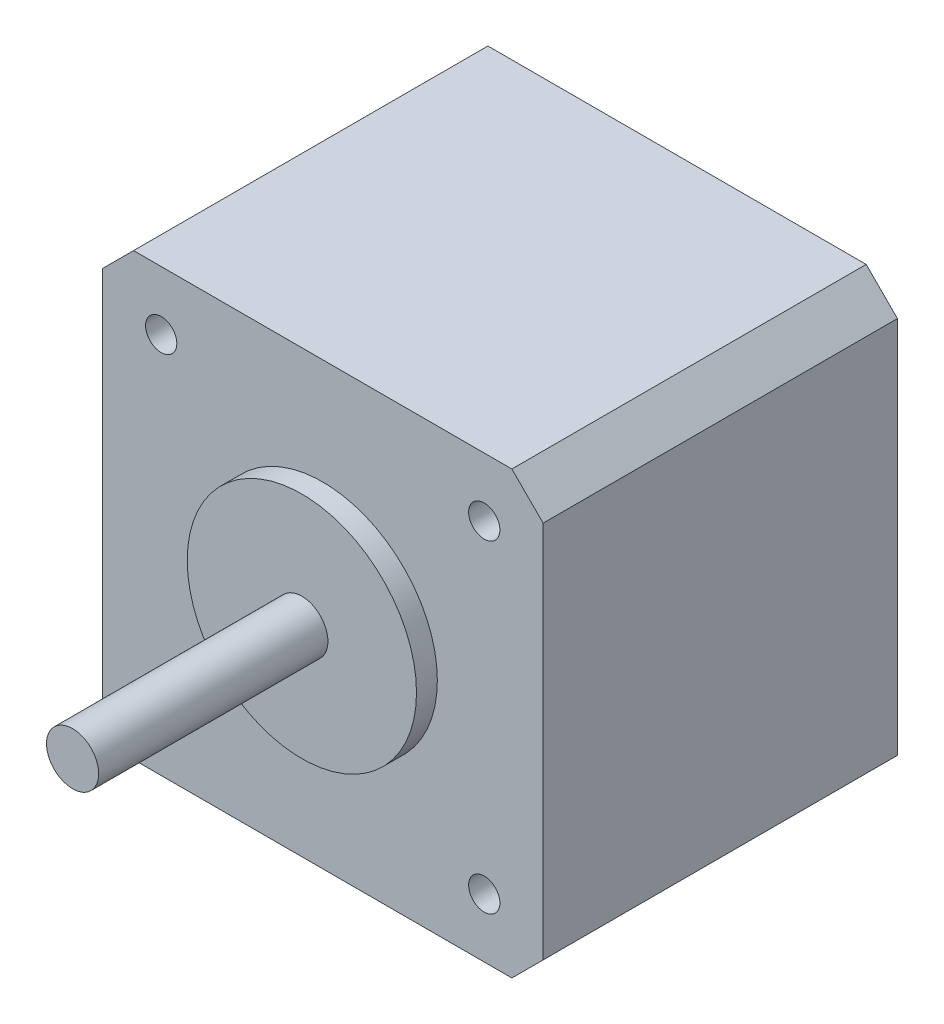
ISO-10303-21;
HEADER;
FILE_DESCRIPTION(('STEP AP214'),'2;1');
FILE_NAME('part.step','',(''),(''),'','','');
FILE_SCHEMA(('AUTOMOTIVE_DESIGN { 1 0 10303 214 1 1 1 1 }'));
ENDSEC;
DATA;
#1=APPLICATION_CONTEXT('core data for automotive mechanical design processes');
#2=APPLICATION_PROTOCOL_DEFINITION('international standard','automotive_design',2000,#1);
#3=PRODUCT_CONTEXT('',#1,'mechanical');
#4=PRODUCT('Part','Part','',(#3));
#5=PRODUCT_RELATED_PRODUCT_CATEGORY('part','',(#4));
#6=PRODUCT_DEFINITION_FORMATION('','',#4);
#7=PRODUCT_DEFINITION_CONTEXT('part definition',#1,'design');
#8=PRODUCT_DEFINITION('design','',#6,#7);
#9=PRODUCT_DEFINITION_SHAPE('','',#8);
#10=(LENGTH_UNIT() NAMED_UNIT(*) SI_UNIT(.MILLI.,.METRE.));
#11=(NAMED_UNIT(*) PLANE_ANGLE_UNIT() SI_UNIT($,.RADIAN.));
#12=(NAMED_UNIT(*) SI_UNIT($,.STERADIAN.) SOLID_ANGLE_UNIT());
#13=UNCERTAINTY_MEASURE_WITH_UNIT(LENGTH_MEASURE(1.E-05),#10,'distance_accuracy_value','');
#14=(GEOMETRIC_REPRESENTATION_CONTEXT(3) GLOBAL_UNCERTAINTY_ASSIGNED_CONTEXT((#13)) GLOBAL_UNIT_ASSIGNED_CONTEXT((#10,
#11,#12)) REPRESENTATION_CONTEXT('',''));
#15=CARTESIAN_POINT('',(0.,0.,0.));
#16=DIRECTION('',(0.,0.,1.));
#17=DIRECTION('',(1.,0.,0.));
#18=AXIS2_PLACEMENT_3D('',#15,#16,#17);
#19=CARTESIAN_POINT('',(58.85,21.15,-4.99999999999999));
#20=DIRECTION('',(-1.,0.,0.));
#21=DIRECTION('',(0.,0.,1.));
#22=AXIS2_PLACEMENT_3D('',#19,#20,#21);
#23=PLANE('',#22);
#24=DIRECTION('',(0.,-1.,0.));
#25=VECTOR('',#24,1.);
#26=CARTESIAN_POINT('',(58.85,21.15,29.));
#27=LINE('',#26,#25);
#28=CARTESIAN_POINT('',(58.85,18.15,29.));
#29=VERTEX_POINT('',#28);
#30=CARTESIAN_POINT('',(58.85,-18.15,29.));
#31=VERTEX_POINT('',#30);
#32=EDGE_CURVE('E165',#29,#31,#27,.T.);
#33=ORIENTED_EDGE('',*,*,#32,.F.);
#34=DIRECTION('',(0.,0.,-1.));
#35=VECTOR('',#34,1.);
#36=CARTESIAN_POINT('',(58.85,18.15,-4.99999999999999));
#37=LINE('',#36,#35);
#38=CARTESIAN_POINT('',(58.85,18.15,-4.99999999999999));
#39=VERTEX_POINT('',#38);
#40=EDGE_CURVE('E139',#29,#39,#37,.T.);
#41=ORIENTED_EDGE('',*,*,#40,.T.);
#42=DIRECTION('',(0.,-1.,0.));
#43=VECTOR('',#42,1.);
#44=CARTESIAN_POINT('',(58.85,21.15,-4.99999999999999));
#45=LINE('',#44,#43);
#46=CARTESIAN_POINT('',(58.85,-18.15,-4.99999999999999));
#47=VERTEX_POINT('',#46);
#48=EDGE_CURVE('E120',#39,#47,#45,.T.);
#49=ORIENTED_EDGE('',*,*,#48,.T.);
#50=DIRECTION('',(0.,0.,1.));
#51=VECTOR('',#50,1.);
#52=CARTESIAN_POINT('',(58.85,-18.15,-4.99999999999999));
#53=LINE('',#52,#51);
#54=EDGE_CURVE('E136',#47,#31,#53,.T.);
#55=ORIENTED_EDGE('',*,*,#54,.T.);
#56=EDGE_LOOP('',(#33,#41,#49,#55));
#57=FACE_BOUND('',#56,.T.);
#58=ADVANCED_FACE('F33',(#57),#23,.T.);
#59=CARTESIAN_POINT('',(101.15,21.15,-4.99999999999999));
#60=DIRECTION('',(0.,1.,0.));
#61=DIRECTION('',(-1.,0.,0.));
#62=AXIS2_PLACEMENT_3D('',#59,#60,#61);
#63=PLANE('',#62);
#64=DIRECTION('',(-1.,0.,0.));
#65=VECTOR('',#64,1.);
#66=CARTESIAN_POINT('',(101.15,21.15,-4.99999999999999));
#67=LINE('',#66,#65);
#68=CARTESIAN_POINT('',(98.15,21.15,-4.99999999999999));
#69=VERTEX_POINT('',#68);
#70=CARTESIAN_POINT('',(61.85,21.15,-4.99999999999999));
#71=VERTEX_POINT('',#70);
#72=EDGE_CURVE('E129',#69,#71,#67,.T.);
#73=ORIENTED_EDGE('',*,*,#72,.T.);
#74=DIRECTION('',(0.,0.,1.));
#75=VECTOR('',#74,1.);
#76=CARTESIAN_POINT('',(61.85,21.15,-4.99999999999999));
#77=LINE('',#76,#75);
#78=CARTESIAN_POINT('',(61.85,21.15,29.));
#79=VERTEX_POINT('',#78);
#80=EDGE_CURVE('E119',#71,#79,#77,.T.);
#81=ORIENTED_EDGE('',*,*,#80,.T.);
#82=DIRECTION('',(-1.,0.,0.));
#83=VECTOR('',#82,1.);
#84=CARTESIAN_POINT('',(101.15,21.15,29.));
#85=LINE('',#84,#83);
#86=CARTESIAN_POINT('',(98.15,21.15,29.));
#87=VERTEX_POINT('',#86);
#88=EDGE_CURVE('E103',#87,#79,#85,.T.);
#89=ORIENTED_EDGE('',*,*,#88,.F.);
#90=DIRECTION('',(0.,0.,-1.));
#91=VECTOR('',#90,1.);
#92=CARTESIAN_POINT('',(98.15,21.15,-4.99999999999999));
#93=LINE('',#92,#91);
#94=EDGE_CURVE('E116',#87,#69,#93,.T.);
#95=ORIENTED_EDGE('',*,*,#94,.T.);
#96=EDGE_LOOP('',(#73,#81,#89,#95));
#97=FACE_BOUND('',#96,.T.);
#98=ADVANCED_FACE('F115',(#97),#63,.T.);
#99=CARTESIAN_POINT('',(101.15,-21.15,-4.99999999999999));
#100=DIRECTION('',(1.,0.,0.));
#101=DIRECTION('',(0.,0.,-1.));
#102=AXIS2_PLACEMENT_3D('',#99,#100,#101);
#103=PLANE('',#102);
#104=DIRECTION('',(0.,1.,0.));
#105=VECTOR('',#104,1.);
#106=CARTESIAN_POINT('',(101.15,-21.15,-4.99999999999999));
#107=LINE('',#106,#105);
#108=CARTESIAN_POINT('',(101.15,-18.15,-4.99999999999999));
#109=VERTEX_POINT('',#108);
#110=CARTESIAN_POINT('',(101.15,18.15,-4.99999999999999));
#111=VERTEX_POINT('',#110);
#112=EDGE_CURVE('E154',#109,#111,#107,.T.);
#113=ORIENTED_EDGE('',*,*,#112,.T.);
#114=DIRECTION('',(0.,0.,1.));
#115=VECTOR('',#114,1.);
#116=CARTESIAN_POINT('',(101.15,18.15,-4.99999999999999));
#117=LINE('',#116,#115);
#118=CARTESIAN_POINT('',(101.15,18.15,29.));
#119=VERTEX_POINT('',#118);
#120=EDGE_CURVE('E11',#111,#119,#117,.T.);
#121=ORIENTED_EDGE('',*,*,#120,.T.);
#122=DIRECTION('',(0.,1.,0.));
#123=VECTOR('',#122,1.);
#124=CARTESIAN_POINT('',(101.15,-21.15,29.));
#125=LINE('',#124,#123);
#126=CARTESIAN_POINT('',(101.15,-18.15,29.));
#127=VERTEX_POINT('',#126);
#128=EDGE_CURVE('E105',#127,#119,#125,.T.);
#129=ORIENTED_EDGE('',*,*,#128,.F.);
#130=DIRECTION('',(0.,0.,-1.));
#131=VECTOR('',#130,1.);
#132=CARTESIAN_POINT('',(101.15,-18.15,-4.99999999999999));
#133=LINE('',#132,#131);
#134=EDGE_CURVE('E41',#127,#109,#133,.T.);
#135=ORIENTED_EDGE('',*,*,#134,.T.);
#136=EDGE_LOOP('',(#113,#121,#129,#135));
#137=FACE_BOUND('',#136,.T.);
#138=ADVANCED_FACE('F153',(#137),#103,.T.);
#139=CARTESIAN_POINT('',(58.85,-21.15,-4.99999999999999));
#140=DIRECTION('',(0.,-1.,0.));
#141=DIRECTION('',(1.,0.,0.));
#142=AXIS2_PLACEMENT_3D('',#139,#140,#141);
#143=PLANE('',#142);
#144=DIRECTION('',(1.,0.,0.));
#145=VECTOR('',#144,1.);
#146=CARTESIAN_POINT('',(58.85,-21.15,29.));
#147=LINE('',#146,#145);
#148=CARTESIAN_POINT('',(61.85,-21.15,29.));
#149=VERTEX_POINT('',#148);
#150=CARTESIAN_POINT('',(98.15,-21.15,29.));
#151=VERTEX_POINT('',#150);
#152=EDGE_CURVE('E163',#149,#151,#147,.T.);
#153=ORIENTED_EDGE('',*,*,#152,.F.);
#154=DIRECTION('',(0.,0.,-1.));
#155=VECTOR('',#154,1.);
#156=CARTESIAN_POINT('',(61.85,-21.15,-4.99999999999999));
#157=LINE('',#156,#155);
#158=CARTESIAN_POINT('',(61.85,-21.15,-4.99999999999999));
#159=VERTEX_POINT('',#158);
#160=EDGE_CURVE('E55',#149,#159,#157,.T.);
#161=ORIENTED_EDGE('',*,*,#160,.T.);
#162=DIRECTION('',(1.,0.,0.));
#163=VECTOR('',#162,1.);
#164=CARTESIAN_POINT('',(58.85,-21.15,-4.99999999999999));
#165=LINE('',#164,#163);
#166=CARTESIAN_POINT('',(98.15,-21.15,-4.99999999999999));
#167=VERTEX_POINT('',#166);
#168=EDGE_CURVE('E158',#159,#167,#165,.T.);
#169=ORIENTED_EDGE('',*,*,#168,.T.);
#170=DIRECTION('',(0.,0.,1.));
#171=VECTOR('',#170,1.);
#172=CARTESIAN_POINT('',(98.15,-21.15,-4.99999999999999));
#173=LINE('',#172,#171);
#174=EDGE_CURVE('E147',#167,#151,#173,.T.);
#175=ORIENTED_EDGE('',*,*,#174,.T.);
#176=EDGE_LOOP('',(#153,#161,#169,#175));
#177=FACE_BOUND('',#176,.T.);
#178=ADVANCED_FACE('F162',(#177),#143,.T.);
#179=CARTESIAN_POINT('',(0.,0.,-4.99999999999999));
#180=DIRECTION('',(0.,0.,1.));
#181=DIRECTION('',(1.,0.,0.));
#182=AXIS2_PLACEMENT_3D('',#179,#180,#181);
#183=PLANE('',#182);
#184=ORIENTED_EDGE('',*,*,#48,.F.);
#185=DIRECTION('',(-0.707106781186545,-0.70710678118655,0.));
#186=VECTOR('',#185,1.);
#187=CARTESIAN_POINT('',(61.85,21.15,-4.99999999999999));
#188=LINE('',#187,#186);
#189=EDGE_CURVE('E145',#39,#71,#188,.F.);
#190=ORIENTED_EDGE('',*,*,#189,.T.);
#191=ORIENTED_EDGE('',*,*,#72,.F.);
#192=DIRECTION('',(-0.707106781186548,0.707106781186548,0.));
#193=VECTOR('',#192,1.);
#194=CARTESIAN_POINT('',(101.15,18.15,-4.99999999999999));
#195=LINE('',#194,#193);
#196=EDGE_CURVE('E124',#69,#111,#195,.F.);
#197=ORIENTED_EDGE('',*,*,#196,.T.);
#198=ORIENTED_EDGE('',*,*,#112,.F.);
#199=DIRECTION('',(0.707106781186546,0.707106781186549,0.));
#200=VECTOR('',#199,1.);
#201=CARTESIAN_POINT('',(98.15,-21.15,-4.99999999999999));
#202=LINE('',#201,#200);
#203=EDGE_CURVE('E48',#109,#167,#202,.F.);
#204=ORIENTED_EDGE('',*,*,#203,.T.);
#205=ORIENTED_EDGE('',*,*,#168,.F.);
#206=DIRECTION('',(0.707106781186548,-0.707106781186547,0.));
#207=VECTOR('',#206,1.);
#208=CARTESIAN_POINT('',(58.85,-18.15,-4.99999999999999));
#209=LINE('',#208,#207);
#210=EDGE_CURVE('E143',#159,#47,#209,.F.);
#211=ORIENTED_EDGE('',*,*,#210,.T.);
#212=EDGE_LOOP('',(#184,#190,#191,#197,#198,#204,#205,#211));
#213=FACE_BOUND('',#212,.T.);
#214=ADVANCED_FACE('F157',(#213),#183,.F.);
#215=CARTESIAN_POINT('',(0.,0.,29.));
#216=DIRECTION('',(0.,0.,1.));
#217=DIRECTION('',(1.,0.,0.));
#218=AXIS2_PLACEMENT_3D('',#215,#216,#217);
#219=PLANE('',#218);
#220=CARTESIAN_POINT('',(95.5,15.5,29.));
#221=DIRECTION('',(0.,0.,1.));
#222=DIRECTION('',(1.,0.,0.));
#223=AXIS2_PLACEMENT_3D('',#220,#221,#222);
#224=CIRCLE('',#223,1.49999999999999);
#225=CARTESIAN_POINT('',(97.,15.5,29.));
#226=VERTEX_POINT('',#225);
#227=EDGE_CURVE('E204',#226,#226,#224,.T.);
#228=ORIENTED_EDGE('',*,*,#227,.F.);
#229=EDGE_LOOP('',(#228));
#230=FACE_BOUND('',#229,.T.);
#231=CARTESIAN_POINT('',(95.5,-15.5,29.));
#232=DIRECTION('',(0.,0.,1.));
#233=DIRECTION('',(1.,0.,0.));
#234=AXIS2_PLACEMENT_3D('',#231,#232,#233);
#235=CIRCLE('',#234,1.49999999999999);
#236=CARTESIAN_POINT('',(97.,-15.5,29.));
#237=VERTEX_POINT('',#236);
#238=EDGE_CURVE('E198',#237,#237,#235,.T.);
#239=ORIENTED_EDGE('',*,*,#238,.F.);
#240=EDGE_LOOP('',(#239));
#241=FACE_BOUND('',#240,.T.);
#242=CARTESIAN_POINT('',(64.5,-15.5,29.));
#243=DIRECTION('',(0.,0.,1.));
#244=DIRECTION('',(1.,0.,0.));
#245=AXIS2_PLACEMENT_3D('',#242,#243,#244);
#246=CIRCLE('',#245,1.49999999999999);
#247=CARTESIAN_POINT('',(66.,-15.5,29.));
#248=VERTEX_POINT('',#247);
#249=EDGE_CURVE('E192',#248,#248,#246,.T.);
#250=ORIENTED_EDGE('',*,*,#249,.F.);
#251=EDGE_LOOP('',(#250));
#252=FACE_BOUND('',#251,.T.);
#253=CARTESIAN_POINT('',(64.5,15.5,29.));
#254=DIRECTION('',(0.,0.,1.));
#255=DIRECTION('',(1.,0.,0.));
#256=AXIS2_PLACEMENT_3D('',#253,#254,#255);
#257=CIRCLE('',#256,1.49999999999999);
#258=CARTESIAN_POINT('',(66.,15.5,29.));
#259=VERTEX_POINT('',#258);
#260=EDGE_CURVE('E186',#259,#259,#257,.T.);
#261=ORIENTED_EDGE('',*,*,#260,.F.);
#262=EDGE_LOOP('',(#261));
#263=FACE_BOUND('',#262,.T.);
#264=CARTESIAN_POINT('',(80.,0.,29.));
#265=DIRECTION('',(0.,0.,1.));
#266=DIRECTION('',(1.,0.,0.));
#267=AXIS2_PLACEMENT_3D('',#264,#265,#266);
#268=CIRCLE('',#267,11.);
#269=CARTESIAN_POINT('',(91.,0.,29.));
#270=VERTEX_POINT('',#269);
#271=EDGE_CURVE('E125',#270,#270,#268,.T.);
#272=ORIENTED_EDGE('',*,*,#271,.F.);
#273=EDGE_LOOP('',(#272));
#274=FACE_BOUND('',#273,.T.);
#275=ORIENTED_EDGE('',*,*,#88,.T.);
#276=DIRECTION('',(0.707106781186545,0.70710678118655,0.));
#277=VECTOR('',#276,1.);
#278=CARTESIAN_POINT('',(20.3500000000002,-20.3500000000001,29.));
#279=LINE('',#278,#277);
#280=EDGE_CURVE('E134',#79,#29,#279,.F.);
#281=ORIENTED_EDGE('',*,*,#280,.T.);
#282=ORIENTED_EDGE('',*,*,#32,.T.);
#283=DIRECTION('',(-0.707106781186548,0.707106781186547,0.));
#284=VECTOR('',#283,1.);
#285=CARTESIAN_POINT('',(20.3499999999999,20.35,29.));
#286=LINE('',#285,#284);
#287=EDGE_CURVE('E109',#31,#149,#286,.F.);
#288=ORIENTED_EDGE('',*,*,#287,.T.);
#289=ORIENTED_EDGE('',*,*,#152,.T.);
#290=DIRECTION('',(-0.707106781186546,-0.707106781186549,0.));
#291=VECTOR('',#290,1.);
#292=CARTESIAN_POINT('',(59.6500000000002,-59.6499999999999,29.));
#293=LINE('',#292,#291);
#294=EDGE_CURVE('E110',#151,#127,#293,.F.);
#295=ORIENTED_EDGE('',*,*,#294,.T.);
#296=ORIENTED_EDGE('',*,*,#128,.T.);
#297=DIRECTION('',(0.707106781186548,-0.707106781186548,0.));
#298=VECTOR('',#297,1.);
#299=CARTESIAN_POINT('',(59.65,59.65,29.));
#300=LINE('',#299,#298);
#301=EDGE_CURVE('E100',#119,#87,#300,.F.);
#302=ORIENTED_EDGE('',*,*,#301,.T.);
#303=EDGE_LOOP('',(#275,#281,#282,#288,#289,#295,#296,#302));
#304=FACE_BOUND('',#303,.T.);
#305=ADVANCED_FACE('F102',(#230,#241,#252,#263,#274,#304),#219,.T.);
#306=CARTESIAN_POINT('',(80.,0.,53.));
#307=DIRECTION('',(0.,0.,-1.));
#308=DIRECTION('',(-1.,0.,0.));
#309=AXIS2_PLACEMENT_3D('',#306,#307,#308);
#310=CYLINDRICAL_SURFACE('',#309,2.5);
#311=CARTESIAN_POINT('',(80.,0.,53.));
#312=DIRECTION('',(0.,0.,-1.));
#313=DIRECTION('',(-1.,0.,0.));
#314=AXIS2_PLACEMENT_3D('',#311,#312,#313);
#315=CIRCLE('',#314,2.5);
#316=CARTESIAN_POINT('',(77.5,0.,53.));
#317=VERTEX_POINT('',#316);
#318=EDGE_CURVE('E168',#317,#317,#315,.T.);
#319=ORIENTED_EDGE('',*,*,#318,.T.);
#320=EDGE_LOOP('',(#319));
#321=FACE_BOUND('',#320,.T.);
#322=CARTESIAN_POINT('',(80.,0.,31.));
#323=DIRECTION('',(0.,0.,-1.));
#324=DIRECTION('',(-1.,0.,0.));
#325=AXIS2_PLACEMENT_3D('',#322,#323,#324);
#326=CIRCLE('',#325,2.5);
#327=CARTESIAN_POINT('',(77.5,0.,31.));
#328=VERTEX_POINT('',#327);
#329=EDGE_CURVE('E180',#328,#328,#326,.T.);
#330=ORIENTED_EDGE('',*,*,#329,.F.);
#331=EDGE_LOOP('',(#330));
#332=FACE_BOUND('',#331,.T.);
#333=ADVANCED_FACE('F212',(#321,#332),#310,.T.);
#334=CARTESIAN_POINT('',(82.5,0.,53.));
#335=DIRECTION('',(0.,0.,1.));
#336=DIRECTION('',(1.,0.,0.));
#337=AXIS2_PLACEMENT_3D('',#334,#335,#336);
#338=PLANE('',#337);
#339=ORIENTED_EDGE('',*,*,#318,.F.);
#340=EDGE_LOOP('',(#339));
#341=FACE_BOUND('',#340,.T.);
#342=ADVANCED_FACE('F225',(#341),#338,.T.);
#343=CARTESIAN_POINT('',(80.,0.,53.));
#344=DIRECTION('',(0.,0.,-1.));
#345=DIRECTION('',(-1.,0.,0.));
#346=AXIS2_PLACEMENT_3D('',#343,#344,#345);
#347=CYLINDRICAL_SURFACE('',#346,11.);
#348=CARTESIAN_POINT('',(80.,0.,31.));
#349=DIRECTION('',(0.,0.,-1.));
#350=DIRECTION('',(-1.,0.,0.));
#351=AXIS2_PLACEMENT_3D('',#348,#349,#350);
#352=CIRCLE('',#351,11.);
#353=CARTESIAN_POINT('',(69.,0.,31.));
#354=VERTEX_POINT('',#353);
#355=EDGE_CURVE('E177',#354,#354,#352,.T.);
#356=ORIENTED_EDGE('',*,*,#355,.T.);
#357=EDGE_LOOP('',(#356));
#358=FACE_BOUND('',#357,.T.);
#359=ORIENTED_EDGE('',*,*,#271,.T.);
#360=EDGE_LOOP('',(#359));
#361=FACE_BOUND('',#360,.T.);
#362=ADVANCED_FACE('F222',(#358,#361),#347,.T.);
#363=CARTESIAN_POINT('',(91.,0.,31.));
#364=DIRECTION('',(0.,0.,1.));
#365=DIRECTION('',(1.,0.,0.));
#366=AXIS2_PLACEMENT_3D('',#363,#364,#365);
#367=PLANE('',#366);
#368=ORIENTED_EDGE('',*,*,#329,.T.);
#369=EDGE_LOOP('',(#368));
#370=FACE_BOUND('',#369,.T.);
#371=ORIENTED_EDGE('',*,*,#355,.F.);
#372=EDGE_LOOP('',(#371));
#373=FACE_BOUND('',#372,.T.);
#374=ADVANCED_FACE('F224',(#370,#373),#367,.T.);
#375=CARTESIAN_POINT('',(64.5,15.5,24.));
#376=DIRECTION('',(0.,0.,-1.));
#377=DIRECTION('',(-1.,0.,0.));
#378=AXIS2_PLACEMENT_3D('',#375,#376,#377);
#379=PLANE('',#378);
#380=CARTESIAN_POINT('',(64.5,15.5,24.));
#381=DIRECTION('',(0.,0.,1.));
#382=DIRECTION('',(1.,0.,0.));
#383=AXIS2_PLACEMENT_3D('',#380,#381,#382);
#384=CIRCLE('',#383,1.49999999999999);
#385=CARTESIAN_POINT('',(66.,15.5,24.));
#386=VERTEX_POINT('',#385);
#387=EDGE_CURVE('E183',#386,#386,#384,.T.);
#388=ORIENTED_EDGE('',*,*,#387,.T.);
#389=EDGE_LOOP('',(#388));
#390=FACE_BOUND('',#389,.T.);
#391=ADVANCED_FACE('F232',(#390),#379,.F.);
#392=CARTESIAN_POINT('',(64.5,15.5,29.));
#393=DIRECTION('',(0.,0.,1.));
#394=DIRECTION('',(1.,0.,0.));
#395=AXIS2_PLACEMENT_3D('',#392,#393,#394);
#396=CYLINDRICAL_SURFACE('',#395,1.49999999999999);
#397=ORIENTED_EDGE('',*,*,#387,.F.);
#398=EDGE_LOOP('',(#397));
#399=FACE_BOUND('',#398,.T.);
#400=ORIENTED_EDGE('',*,*,#260,.T.);
#401=EDGE_LOOP('',(#400));
#402=FACE_BOUND('',#401,.T.);
#403=ADVANCED_FACE('F376',(#399,#402),#396,.F.);
#404=CARTESIAN_POINT('',(64.5,-15.5,24.));
#405=DIRECTION('',(0.,0.,-1.));
#406=DIRECTION('',(-1.,0.,0.));
#407=AXIS2_PLACEMENT_3D('',#404,#405,#406);
#408=PLANE('',#407);
#409=CARTESIAN_POINT('',(64.5,-15.5,24.));
#410=DIRECTION('',(0.,0.,1.));
#411=DIRECTION('',(1.,0.,0.));
#412=AXIS2_PLACEMENT_3D('',#409,#410,#411);
#413=CIRCLE('',#412,1.49999999999999);
#414=CARTESIAN_POINT('',(66.,-15.5,24.));
#415=VERTEX_POINT('',#414);
#416=EDGE_CURVE('E189',#415,#415,#413,.T.);
#417=ORIENTED_EDGE('',*,*,#416,.T.);
#418=EDGE_LOOP('',(#417));
#419=FACE_BOUND('',#418,.T.);
#420=ADVANCED_FACE('F366',(#419),#408,.F.);
#421=CARTESIAN_POINT('',(64.5,-15.5,29.));
#422=DIRECTION('',(0.,0.,1.));
#423=DIRECTION('',(1.,0.,0.));
#424=AXIS2_PLACEMENT_3D('',#421,#422,#423);
#425=CYLINDRICAL_SURFACE('',#424,1.49999999999999);
#426=ORIENTED_EDGE('',*,*,#416,.F.);
#427=EDGE_LOOP('',(#426));
#428=FACE_BOUND('',#427,.T.);
#429=ORIENTED_EDGE('',*,*,#249,.T.);
#430=EDGE_LOOP('',(#429));
#431=FACE_BOUND('',#430,.T.);
#432=ADVANCED_FACE('F356',(#428,#431),#425,.F.);
#433=CARTESIAN_POINT('',(95.5,-15.5,24.));
#434=DIRECTION('',(0.,0.,-1.));
#435=DIRECTION('',(-1.,0.,0.));
#436=AXIS2_PLACEMENT_3D('',#433,#434,#435);
#437=PLANE('',#436);
#438=CARTESIAN_POINT('',(95.5,-15.5,24.));
#439=DIRECTION('',(0.,0.,1.));
#440=DIRECTION('',(1.,0.,0.));
#441=AXIS2_PLACEMENT_3D('',#438,#439,#440);
#442=CIRCLE('',#441,1.49999999999999);
#443=CARTESIAN_POINT('',(97.,-15.5,24.));
#444=VERTEX_POINT('',#443);
#445=EDGE_CURVE('E195',#444,#444,#442,.T.);
#446=ORIENTED_EDGE('',*,*,#445,.T.);
#447=EDGE_LOOP('',(#446));
#448=FACE_BOUND('',#447,.T.);
#449=ADVANCED_FACE('F346',(#448),#437,.F.);
#450=CARTESIAN_POINT('',(95.5,-15.5,29.));
#451=DIRECTION('',(0.,0.,1.));
#452=DIRECTION('',(1.,0.,0.));
#453=AXIS2_PLACEMENT_3D('',#450,#451,#452);
#454=CYLINDRICAL_SURFACE('',#453,1.49999999999999);
#455=ORIENTED_EDGE('',*,*,#445,.F.);
#456=EDGE_LOOP('',(#455));
#457=FACE_BOUND('',#456,.T.);
#458=ORIENTED_EDGE('',*,*,#238,.T.);
#459=EDGE_LOOP('',(#458));
#460=FACE_BOUND('',#459,.T.);
#461=ADVANCED_FACE('F336',(#457,#460),#454,.F.);
#462=CARTESIAN_POINT('',(95.5,15.5,24.));
#463=DIRECTION('',(0.,0.,-1.));
#464=DIRECTION('',(-1.,0.,0.));
#465=AXIS2_PLACEMENT_3D('',#462,#463,#464);
#466=PLANE('',#465);
#467=CARTESIAN_POINT('',(95.5,15.5,24.));
#468=DIRECTION('',(0.,0.,1.));
#469=DIRECTION('',(1.,0.,0.));
#470=AXIS2_PLACEMENT_3D('',#467,#468,#469);
#471=CIRCLE('',#470,1.49999999999999);
#472=CARTESIAN_POINT('',(97.,15.5,24.));
#473=VERTEX_POINT('',#472);
#474=EDGE_CURVE('E201',#473,#473,#471,.T.);
#475=ORIENTED_EDGE('',*,*,#474,.T.);
#476=EDGE_LOOP('',(#475));
#477=FACE_BOUND('',#476,.T.);
#478=ADVANCED_FACE('F326',(#477),#466,.F.);
#479=CARTESIAN_POINT('',(95.5,15.5,29.));
#480=DIRECTION('',(0.,0.,1.));
#481=DIRECTION('',(1.,0.,0.));
#482=AXIS2_PLACEMENT_3D('',#479,#480,#481);
#483=CYLINDRICAL_SURFACE('',#482,1.49999999999999);
#484=ORIENTED_EDGE('',*,*,#474,.F.);
#485=EDGE_LOOP('',(#484));
#486=FACE_BOUND('',#485,.T.);
#487=ORIENTED_EDGE('',*,*,#227,.T.);
#488=EDGE_LOOP('',(#487));
#489=FACE_BOUND('',#488,.T.);
#490=ADVANCED_FACE('F208',(#486,#489),#483,.F.);
#491=CARTESIAN_POINT('',(61.85,21.15,-4.99999999999999));
#492=DIRECTION('',(0.70710678118655,-0.707106781186545,0.));
#493=DIRECTION('',(0.,0.,1.));
#494=AXIS2_PLACEMENT_3D('',#491,#492,#493);
#495=PLANE('',#494);
#496=ORIENTED_EDGE('',*,*,#189,.F.);
#497=ORIENTED_EDGE('',*,*,#40,.F.);
#498=ORIENTED_EDGE('',*,*,#280,.F.);
#499=ORIENTED_EDGE('',*,*,#80,.F.);
#500=EDGE_LOOP('',(#496,#497,#498,#499));
#501=FACE_BOUND('',#500,.T.);
#502=ADVANCED_FACE('F248',(#501),#495,.F.);
#503=CARTESIAN_POINT('',(58.85,-18.15,-4.99999999999999));
#504=DIRECTION('',(0.707106781186547,0.707106781186548,0.));
#505=DIRECTION('',(0.,0.,1.));
#506=AXIS2_PLACEMENT_3D('',#503,#504,#505);
#507=PLANE('',#506);
#508=ORIENTED_EDGE('',*,*,#210,.F.);
#509=ORIENTED_EDGE('',*,*,#160,.F.);
#510=ORIENTED_EDGE('',*,*,#287,.F.);
#511=ORIENTED_EDGE('',*,*,#54,.F.);
#512=EDGE_LOOP('',(#508,#509,#510,#511));
#513=FACE_BOUND('',#512,.T.);
#514=ADVANCED_FACE('F251',(#513),#507,.F.);
#515=CARTESIAN_POINT('',(101.15,18.15,-4.99999999999999));
#516=DIRECTION('',(-0.707106781186548,-0.707106781186548,0.));
#517=DIRECTION('',(0.,0.,1.));
#518=AXIS2_PLACEMENT_3D('',#515,#516,#517);
#519=PLANE('',#518);
#520=ORIENTED_EDGE('',*,*,#196,.F.);
#521=ORIENTED_EDGE('',*,*,#94,.F.);
#522=ORIENTED_EDGE('',*,*,#301,.F.);
#523=ORIENTED_EDGE('',*,*,#120,.F.);
#524=EDGE_LOOP('',(#520,#521,#522,#523));
#525=FACE_BOUND('',#524,.T.);
#526=ADVANCED_FACE('F123',(#525),#519,.F.);
#527=CARTESIAN_POINT('',(98.15,-21.15,-4.99999999999999));
#528=DIRECTION('',(-0.707106781186549,0.707106781186546,0.));
#529=DIRECTION('',(0.,0.,1.));
#530=AXIS2_PLACEMENT_3D('',#527,#528,#529);
#531=PLANE('',#530);
#532=ORIENTED_EDGE('',*,*,#203,.F.);
#533=ORIENTED_EDGE('',*,*,#134,.F.);
#534=ORIENTED_EDGE('',*,*,#294,.F.);
#535=ORIENTED_EDGE('',*,*,#174,.F.);
#536=EDGE_LOOP('',(#532,#533,#534,#535));
#537=FACE_BOUND('',#536,.T.);
#538=ADVANCED_FACE('F35',(#537),#531,.F.);
#539=CLOSED_SHELL('',(#58,#98,#138,#178,#214,#305,#333,#342,#362,#374,#391,#403,#420,#432,#449,
#461,#478,#490,#502,#514,#526,#538));
#540=MANIFOLD_SOLID_BREP('B2',#539);
#541=ADVANCED_BREP_SHAPE_REPRESENTATION('',(#18,#540),#14);
#542=SHAPE_DEFINITION_REPRESENTATION(#9,#541);
ENDSEC;
END-ISO-10303-21;
